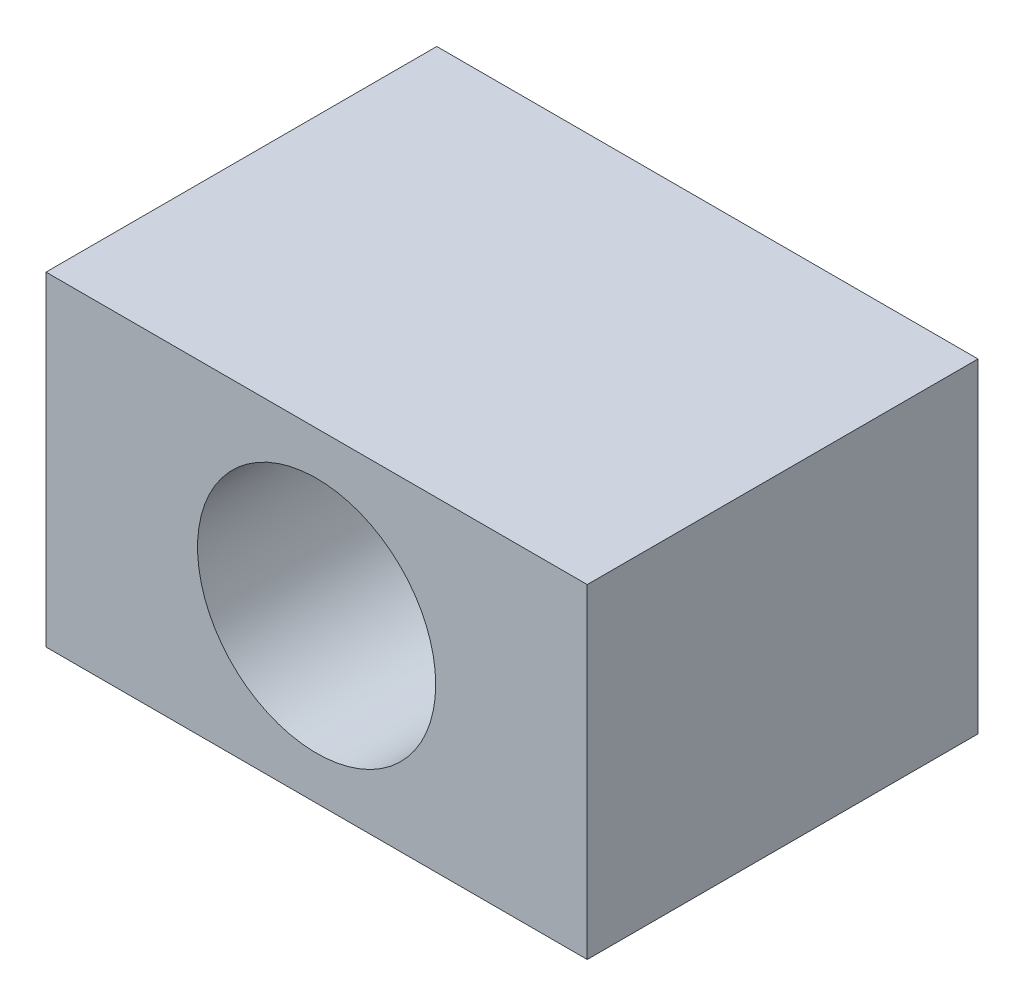
ISO-10303-21;
HEADER;
FILE_DESCRIPTION(('STEP AP214'),'2;1');
FILE_NAME('part.step','',(''),(''),'','','');
FILE_SCHEMA(('AUTOMOTIVE_DESIGN { 1 0 10303 214 1 1 1 1 }'));
ENDSEC;
DATA;
#1=APPLICATION_CONTEXT('core data for automotive mechanical design processes');
#2=APPLICATION_PROTOCOL_DEFINITION('international standard','automotive_design',2000,#1);
#3=PRODUCT_CONTEXT('',#1,'mechanical');
#4=PRODUCT('Part','Part','',(#3));
#5=PRODUCT_RELATED_PRODUCT_CATEGORY('part','',(#4));
#6=PRODUCT_DEFINITION_FORMATION('','',#4);
#7=PRODUCT_DEFINITION_CONTEXT('part definition',#1,'design');
#8=PRODUCT_DEFINITION('design','',#6,#7);
#9=PRODUCT_DEFINITION_SHAPE('','',#8);
#10=(LENGTH_UNIT() NAMED_UNIT(*) SI_UNIT(.MILLI.,.METRE.));
#11=(NAMED_UNIT(*) PLANE_ANGLE_UNIT() SI_UNIT($,.RADIAN.));
#12=(NAMED_UNIT(*) SI_UNIT($,.STERADIAN.) SOLID_ANGLE_UNIT());
#13=UNCERTAINTY_MEASURE_WITH_UNIT(LENGTH_MEASURE(1.E-05),#10,'distance_accuracy_value','');
#14=(GEOMETRIC_REPRESENTATION_CONTEXT(3) GLOBAL_UNCERTAINTY_ASSIGNED_CONTEXT((#13)) GLOBAL_UNIT_ASSIGNED_CONTEXT((#10,
#11,#12)) REPRESENTATION_CONTEXT('',''));
#15=CARTESIAN_POINT('',(0.,0.,0.));
#16=DIRECTION('',(0.,0.,1.));
#17=DIRECTION('',(1.,0.,0.));
#18=AXIS2_PLACEMENT_3D('',#15,#16,#17);
#19=CARTESIAN_POINT('',(0.,0.,36.1));
#20=DIRECTION('',(0.,0.,1.));
#21=DIRECTION('',(1.,0.,0.));
#22=AXIS2_PLACEMENT_3D('',#19,#20,#21);
#23=PLANE('',#22);
#24=DIRECTION('',(1.,0.,0.));
#25=VECTOR('',#24,1.);
#26=CARTESIAN_POINT('',(-25.,-15.,36.1));
#27=LINE('',#26,#25);
#28=CARTESIAN_POINT('',(-25.,-15.,36.1));
#29=VERTEX_POINT('',#28);
#30=CARTESIAN_POINT('',(25.,-15.,36.1));
#31=VERTEX_POINT('',#30);
#32=EDGE_CURVE('E84',#29,#31,#27,.T.);
#33=ORIENTED_EDGE('',*,*,#32,.T.);
#34=DIRECTION('',(0.,1.,0.));
#35=VECTOR('',#34,1.);
#36=CARTESIAN_POINT('',(25.,-15.,36.1));
#37=LINE('',#36,#35);
#38=CARTESIAN_POINT('',(25.,15.,36.1));
#39=VERTEX_POINT('',#38);
#40=EDGE_CURVE('E78',#31,#39,#37,.T.);
#41=ORIENTED_EDGE('',*,*,#40,.T.);
#42=DIRECTION('',(-1.,0.,0.));
#43=VECTOR('',#42,1.);
#44=CARTESIAN_POINT('',(15.,15.,36.1));
#45=LINE('',#44,#43);
#46=CARTESIAN_POINT('',(-25.,15.,36.1));
#47=VERTEX_POINT('',#46);
#48=EDGE_CURVE('E81',#39,#47,#45,.T.);
#49=ORIENTED_EDGE('',*,*,#48,.T.);
#50=DIRECTION('',(0.,-1.,0.));
#51=VECTOR('',#50,1.);
#52=CARTESIAN_POINT('',(-25.,15.,36.1));
#53=LINE('',#52,#51);
#54=EDGE_CURVE('E51',#47,#29,#53,.T.);
#55=ORIENTED_EDGE('',*,*,#54,.T.);
#56=EDGE_LOOP('',(#33,#41,#49,#55));
#57=FACE_BOUND('',#56,.T.);
#58=CARTESIAN_POINT('',(0.,0.,36.1));
#59=DIRECTION('',(0.,0.,1.));
#60=DIRECTION('',(1.,0.,0.));
#61=AXIS2_PLACEMENT_3D('',#58,#59,#60);
#62=CIRCLE('',#61,11.);
#63=CARTESIAN_POINT('',(11.,0.,36.1));
#64=VERTEX_POINT('',#63);
#65=EDGE_CURVE('E102',#64,#64,#62,.T.);
#66=ORIENTED_EDGE('',*,*,#65,.F.);
#67=EDGE_LOOP('',(#66));
#68=FACE_BOUND('',#67,.T.);
#69=ADVANCED_FACE('F34',(#57,#68),#23,.T.);
#70=CARTESIAN_POINT('',(0.,0.,0.));
#71=DIRECTION('',(0.,0.,1.));
#72=DIRECTION('',(1.,0.,0.));
#73=AXIS2_PLACEMENT_3D('',#70,#71,#72);
#74=PLANE('',#73);
#75=DIRECTION('',(1.,0.,0.));
#76=VECTOR('',#75,1.);
#77=CARTESIAN_POINT('',(-25.,-15.,0.));
#78=LINE('',#77,#76);
#79=CARTESIAN_POINT('',(-25.,-15.,0.));
#80=VERTEX_POINT('',#79);
#81=CARTESIAN_POINT('',(25.,-15.,0.));
#82=VERTEX_POINT('',#81);
#83=EDGE_CURVE('E99',#80,#82,#78,.T.);
#84=ORIENTED_EDGE('',*,*,#83,.F.);
#85=DIRECTION('',(0.,-1.,0.));
#86=VECTOR('',#85,1.);
#87=CARTESIAN_POINT('',(-25.,-15.,0.));
#88=LINE('',#87,#86);
#89=CARTESIAN_POINT('',(-25.,15.,0.));
#90=VERTEX_POINT('',#89);
#91=EDGE_CURVE('E67',#90,#80,#88,.T.);
#92=ORIENTED_EDGE('',*,*,#91,.F.);
#93=DIRECTION('',(-1.,0.,0.));
#94=VECTOR('',#93,1.);
#95=CARTESIAN_POINT('',(-15.,15.,0.));
#96=LINE('',#95,#94);
#97=CARTESIAN_POINT('',(25.,15.,0.));
#98=VERTEX_POINT('',#97);
#99=EDGE_CURVE('E104',#98,#90,#96,.T.);
#100=ORIENTED_EDGE('',*,*,#99,.F.);
#101=DIRECTION('',(0.,1.,0.));
#102=VECTOR('',#101,1.);
#103=CARTESIAN_POINT('',(25.,15.,0.));
#104=LINE('',#103,#102);
#105=EDGE_CURVE('E90',#82,#98,#104,.T.);
#106=ORIENTED_EDGE('',*,*,#105,.F.);
#107=EDGE_LOOP('',(#84,#92,#100,#106));
#108=FACE_BOUND('',#107,.T.);
#109=CARTESIAN_POINT('',(0.,0.,0.));
#110=DIRECTION('',(0.,0.,1.));
#111=DIRECTION('',(1.,0.,0.));
#112=AXIS2_PLACEMENT_3D('',#109,#110,#111);
#113=CIRCLE('',#112,11.);
#114=CARTESIAN_POINT('',(11.,0.,0.));
#115=VERTEX_POINT('',#114);
#116=EDGE_CURVE('E111',#115,#115,#113,.T.);
#117=ORIENTED_EDGE('',*,*,#116,.T.);
#118=EDGE_LOOP('',(#117));
#119=FACE_BOUND('',#118,.T.);
#120=ADVANCED_FACE('F152',(#108,#119),#74,.F.);
#121=CARTESIAN_POINT('',(-25.,-15.,36.1));
#122=DIRECTION('',(0.,1.,0.));
#123=DIRECTION('',(-1.,0.,0.));
#124=AXIS2_PLACEMENT_3D('',#121,#122,#123);
#125=PLANE('',#124);
#126=CARTESIAN_POINT('',(-17.5,-15.,30.05));
#127=DIRECTION('',(0.,-1.,0.));
#128=DIRECTION('',(1.,0.,0.));
#129=AXIS2_PLACEMENT_3D('',#126,#127,#128);
#130=CIRCLE('',#129,2.15);
#131=CARTESIAN_POINT('',(-15.35,-15.,30.05));
#132=VERTEX_POINT('',#131);
#133=EDGE_CURVE('E130',#132,#132,#130,.T.);
#134=ORIENTED_EDGE('',*,*,#133,.F.);
#135=EDGE_LOOP('',(#134));
#136=FACE_BOUND('',#135,.T.);
#137=CARTESIAN_POINT('',(17.5,-15.,6.05));
#138=DIRECTION('',(0.,-1.,0.));
#139=DIRECTION('',(1.,0.,0.));
#140=AXIS2_PLACEMENT_3D('',#137,#138,#139);
#141=CIRCLE('',#140,2.15);
#142=CARTESIAN_POINT('',(19.65,-15.,6.05));
#143=VERTEX_POINT('',#142);
#144=EDGE_CURVE('E123',#143,#143,#141,.T.);
#145=ORIENTED_EDGE('',*,*,#144,.F.);
#146=EDGE_LOOP('',(#145));
#147=FACE_BOUND('',#146,.T.);
#148=CARTESIAN_POINT('',(-17.5,-15.,6.05));
#149=DIRECTION('',(0.,-1.,0.));
#150=DIRECTION('',(1.,0.,0.));
#151=AXIS2_PLACEMENT_3D('',#148,#149,#150);
#152=CIRCLE('',#151,2.15);
#153=CARTESIAN_POINT('',(-15.35,-15.,6.05));
#154=VERTEX_POINT('',#153);
#155=EDGE_CURVE('E135',#154,#154,#152,.T.);
#156=ORIENTED_EDGE('',*,*,#155,.F.);
#157=EDGE_LOOP('',(#156));
#158=FACE_BOUND('',#157,.T.);
#159=CARTESIAN_POINT('',(17.5,-15.,30.05));
#160=DIRECTION('',(0.,-1.,0.));
#161=DIRECTION('',(1.,0.,0.));
#162=AXIS2_PLACEMENT_3D('',#159,#160,#161);
#163=CIRCLE('',#162,2.15);
#164=CARTESIAN_POINT('',(19.65,-15.,30.05));
#165=VERTEX_POINT('',#164);
#166=EDGE_CURVE('E117',#165,#165,#163,.T.);
#167=ORIENTED_EDGE('',*,*,#166,.F.);
#168=EDGE_LOOP('',(#167));
#169=FACE_BOUND('',#168,.T.);
#170=ORIENTED_EDGE('',*,*,#83,.T.);
#171=DIRECTION('',(0.,0.,-1.));
#172=VECTOR('',#171,1.);
#173=CARTESIAN_POINT('',(25.,-15.,36.1));
#174=LINE('',#173,#172);
#175=EDGE_CURVE('E11',#31,#82,#174,.T.);
#176=ORIENTED_EDGE('',*,*,#175,.F.);
#177=ORIENTED_EDGE('',*,*,#32,.F.);
#178=DIRECTION('',(0.,0.,-1.));
#179=VECTOR('',#178,1.);
#180=CARTESIAN_POINT('',(-25.,-15.,36.1));
#181=LINE('',#180,#179);
#182=EDGE_CURVE('E95',#29,#80,#181,.T.);
#183=ORIENTED_EDGE('',*,*,#182,.T.);
#184=EDGE_LOOP('',(#170,#176,#177,#183));
#185=FACE_BOUND('',#184,.T.);
#186=ADVANCED_FACE('F36',(#136,#147,#158,#169,#185),#125,.F.);
#187=CARTESIAN_POINT('',(25.,15.,36.1));
#188=DIRECTION('',(-1.,0.,0.));
#189=DIRECTION('',(0.,0.,1.));
#190=AXIS2_PLACEMENT_3D('',#187,#188,#189);
#191=PLANE('',#190);
#192=ORIENTED_EDGE('',*,*,#105,.T.);
#193=DIRECTION('',(0.,0.,-1.));
#194=VECTOR('',#193,1.);
#195=CARTESIAN_POINT('',(25.,15.,36.1));
#196=LINE('',#195,#194);
#197=EDGE_CURVE('E43',#39,#98,#196,.T.);
#198=ORIENTED_EDGE('',*,*,#197,.F.);
#199=ORIENTED_EDGE('',*,*,#40,.F.);
#200=ORIENTED_EDGE('',*,*,#175,.T.);
#201=EDGE_LOOP('',(#192,#198,#199,#200));
#202=FACE_BOUND('',#201,.T.);
#203=ADVANCED_FACE('F89',(#202),#191,.F.);
#204=CARTESIAN_POINT('',(-15.,15.,36.1));
#205=DIRECTION('',(0.,-1.,0.));
#206=DIRECTION('',(0.,0.,-1.));
#207=AXIS2_PLACEMENT_3D('',#204,#205,#206);
#208=PLANE('',#207);
#209=ORIENTED_EDGE('',*,*,#99,.T.);
#210=DIRECTION('',(0.,0.,-1.));
#211=VECTOR('',#210,1.);
#212=CARTESIAN_POINT('',(-25.,15.,36.1));
#213=LINE('',#212,#211);
#214=EDGE_CURVE('E92',#47,#90,#213,.T.);
#215=ORIENTED_EDGE('',*,*,#214,.F.);
#216=ORIENTED_EDGE('',*,*,#48,.F.);
#217=ORIENTED_EDGE('',*,*,#197,.T.);
#218=EDGE_LOOP('',(#209,#215,#216,#217));
#219=FACE_BOUND('',#218,.T.);
#220=ADVANCED_FACE('F93',(#219),#208,.F.);
#221=CARTESIAN_POINT('',(-25.,-15.,36.1));
#222=DIRECTION('',(1.,0.,0.));
#223=DIRECTION('',(0.,0.,-1.));
#224=AXIS2_PLACEMENT_3D('',#221,#222,#223);
#225=PLANE('',#224);
#226=ORIENTED_EDGE('',*,*,#91,.T.);
#227=ORIENTED_EDGE('',*,*,#182,.F.);
#228=ORIENTED_EDGE('',*,*,#54,.F.);
#229=ORIENTED_EDGE('',*,*,#214,.T.);
#230=EDGE_LOOP('',(#226,#227,#228,#229));
#231=FACE_BOUND('',#230,.T.);
#232=ADVANCED_FACE('F108',(#231),#225,.F.);
#233=CARTESIAN_POINT('',(0.,0.,36.1));
#234=DIRECTION('',(0.,0.,-1.));
#235=DIRECTION('',(-1.,0.,0.));
#236=AXIS2_PLACEMENT_3D('',#233,#234,#235);
#237=CYLINDRICAL_SURFACE('',#236,11.);
#238=ORIENTED_EDGE('',*,*,#65,.T.);
#239=EDGE_LOOP('',(#238));
#240=FACE_BOUND('',#239,.T.);
#241=ORIENTED_EDGE('',*,*,#116,.F.);
#242=EDGE_LOOP('',(#241));
#243=FACE_BOUND('',#242,.T.);
#244=ADVANCED_FACE('F158',(#240,#243),#237,.F.);
#245=CARTESIAN_POINT('',(17.5,2.00000000000001,30.05));
#246=DIRECTION('',(0.,-1.,0.));
#247=DIRECTION('',(1.,0.,0.));
#248=AXIS2_PLACEMENT_3D('',#245,#246,#247);
#249=CYLINDRICAL_SURFACE('',#248,2.15);
#250=CARTESIAN_POINT('',(17.5,2.00000000000001,30.05));
#251=DIRECTION('',(0.,-1.,0.));
#252=DIRECTION('',(1.,0.,0.));
#253=AXIS2_PLACEMENT_3D('',#250,#251,#252);
#254=CIRCLE('',#253,2.15);
#255=CARTESIAN_POINT('',(19.65,2.00000000000001,30.05));
#256=VERTEX_POINT('',#255);
#257=EDGE_CURVE('E114',#256,#256,#254,.T.);
#258=ORIENTED_EDGE('',*,*,#257,.F.);
#259=EDGE_LOOP('',(#258));
#260=FACE_BOUND('',#259,.T.);
#261=ORIENTED_EDGE('',*,*,#166,.T.);
#262=EDGE_LOOP('',(#261));
#263=FACE_BOUND('',#262,.T.);
#264=ADVANCED_FACE('F156',(#260,#263),#249,.F.);
#265=CARTESIAN_POINT('',(17.5,2.00000000000001,30.05));
#266=DIRECTION('',(0.,-1.,0.));
#267=DIRECTION('',(1.,0.,0.));
#268=AXIS2_PLACEMENT_3D('',#265,#266,#267);
#269=PLANE('',#268);
#270=ORIENTED_EDGE('',*,*,#257,.T.);
#271=EDGE_LOOP('',(#270));
#272=FACE_BOUND('',#271,.T.);
#273=ADVANCED_FACE('F146',(#272),#269,.T.);
#274=CARTESIAN_POINT('',(-17.5,2.00000000000001,6.05));
#275=DIRECTION('',(0.,-1.,0.));
#276=DIRECTION('',(1.,0.,0.));
#277=AXIS2_PLACEMENT_3D('',#274,#275,#276);
#278=CYLINDRICAL_SURFACE('',#277,2.15);
#279=CARTESIAN_POINT('',(-17.5,2.00000000000001,6.05));
#280=DIRECTION('',(0.,-1.,0.));
#281=DIRECTION('',(1.,0.,0.));
#282=AXIS2_PLACEMENT_3D('',#279,#280,#281);
#283=CIRCLE('',#282,2.15);
#284=CARTESIAN_POINT('',(-15.35,2.00000000000001,6.05));
#285=VERTEX_POINT('',#284);
#286=EDGE_CURVE('E127',#285,#285,#283,.T.);
#287=ORIENTED_EDGE('',*,*,#286,.F.);
#288=EDGE_LOOP('',(#287));
#289=FACE_BOUND('',#288,.T.);
#290=ORIENTED_EDGE('',*,*,#155,.T.);
#291=EDGE_LOOP('',(#290));
#292=FACE_BOUND('',#291,.T.);
#293=ADVANCED_FACE('F143',(#289,#292),#278,.F.);
#294=CARTESIAN_POINT('',(-17.5,2.00000000000001,6.05));
#295=DIRECTION('',(0.,-1.,0.));
#296=DIRECTION('',(1.,0.,0.));
#297=AXIS2_PLACEMENT_3D('',#294,#295,#296);
#298=PLANE('',#297);
#299=ORIENTED_EDGE('',*,*,#286,.T.);
#300=EDGE_LOOP('',(#299));
#301=FACE_BOUND('',#300,.T.);
#302=ADVANCED_FACE('F141',(#301),#298,.T.);
#303=CARTESIAN_POINT('',(17.5,2.00000000000001,6.05));
#304=DIRECTION('',(0.,-1.,0.));
#305=DIRECTION('',(1.,0.,0.));
#306=AXIS2_PLACEMENT_3D('',#303,#304,#305);
#307=CYLINDRICAL_SURFACE('',#306,2.15);
#308=CARTESIAN_POINT('',(17.5,2.00000000000001,6.05));
#309=DIRECTION('',(0.,-1.,0.));
#310=DIRECTION('',(1.,0.,0.));
#311=AXIS2_PLACEMENT_3D('',#308,#309,#310);
#312=CIRCLE('',#311,2.15);
#313=CARTESIAN_POINT('',(19.65,2.00000000000001,6.05));
#314=VERTEX_POINT('',#313);
#315=EDGE_CURVE('E126',#314,#314,#312,.T.);
#316=ORIENTED_EDGE('',*,*,#315,.F.);
#317=EDGE_LOOP('',(#316));
#318=FACE_BOUND('',#317,.T.);
#319=ORIENTED_EDGE('',*,*,#144,.T.);
#320=EDGE_LOOP('',(#319));
#321=FACE_BOUND('',#320,.T.);
#322=ADVANCED_FACE('F229',(#318,#321),#307,.F.);
#323=CARTESIAN_POINT('',(17.5,2.00000000000001,6.05));
#324=DIRECTION('',(0.,-1.,0.));
#325=DIRECTION('',(1.,0.,0.));
#326=AXIS2_PLACEMENT_3D('',#323,#324,#325);
#327=PLANE('',#326);
#328=ORIENTED_EDGE('',*,*,#315,.T.);
#329=EDGE_LOOP('',(#328));
#330=FACE_BOUND('',#329,.T.);
#331=ADVANCED_FACE('F238',(#330),#327,.T.);
#332=CARTESIAN_POINT('',(-17.5,2.00000000000001,30.05));
#333=DIRECTION('',(0.,-1.,0.));
#334=DIRECTION('',(1.,0.,0.));
#335=AXIS2_PLACEMENT_3D('',#332,#333,#334);
#336=CYLINDRICAL_SURFACE('',#335,2.15);
#337=CARTESIAN_POINT('',(-17.5,2.00000000000001,30.05));
#338=DIRECTION('',(0.,-1.,0.));
#339=DIRECTION('',(1.,0.,0.));
#340=AXIS2_PLACEMENT_3D('',#337,#338,#339);
#341=CIRCLE('',#340,2.15);
#342=CARTESIAN_POINT('',(-15.35,2.00000000000001,30.05));
#343=VERTEX_POINT('',#342);
#344=EDGE_CURVE('E120',#343,#343,#341,.T.);
#345=ORIENTED_EDGE('',*,*,#344,.F.);
#346=EDGE_LOOP('',(#345));
#347=FACE_BOUND('',#346,.T.);
#348=ORIENTED_EDGE('',*,*,#133,.T.);
#349=EDGE_LOOP('',(#348));
#350=FACE_BOUND('',#349,.T.);
#351=ADVANCED_FACE('F248',(#347,#350),#336,.F.);
#352=CARTESIAN_POINT('',(-17.5,2.00000000000001,30.05));
#353=DIRECTION('',(0.,-1.,0.));
#354=DIRECTION('',(1.,0.,0.));
#355=AXIS2_PLACEMENT_3D('',#352,#353,#354);
#356=PLANE('',#355);
#357=ORIENTED_EDGE('',*,*,#344,.T.);
#358=EDGE_LOOP('',(#357));
#359=FACE_BOUND('',#358,.T.);
#360=ADVANCED_FACE('F258',(#359),#356,.T.);
#361=CLOSED_SHELL('',(#69,#120,#186,#203,#220,#232,#244,#264,#273,#293,#302,#322,#331,#351,#360));
#362=MANIFOLD_SOLID_BREP('B2',#361);
#363=ADVANCED_BREP_SHAPE_REPRESENTATION('',(#18,#362),#14);
#364=SHAPE_DEFINITION_REPRESENTATION(#9,#363);
ENDSEC;
END-ISO-10303-21;
